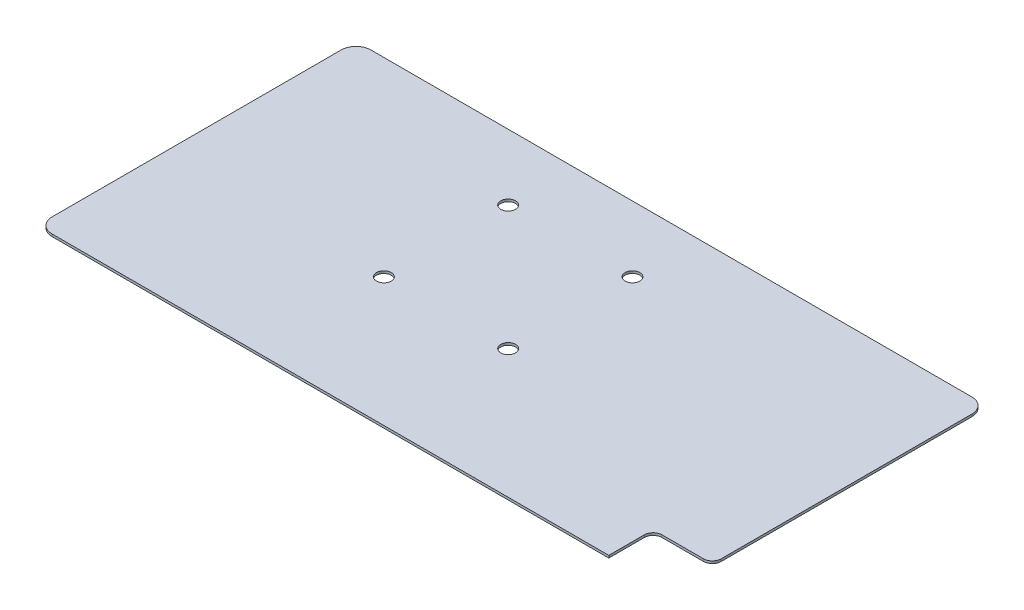
ISO-10303-21;
HEADER;
FILE_DESCRIPTION(('STEP AP214'),'2;1');
FILE_NAME('part.step','',(''),(''),'','','');
FILE_SCHEMA(('AUTOMOTIVE_DESIGN { 1 0 10303 214 1 1 1 1 }'));
ENDSEC;
DATA;
#1=APPLICATION_CONTEXT('core data for automotive mechanical design processes');
#2=APPLICATION_PROTOCOL_DEFINITION('international standard','automotive_design',2000,#1);
#3=PRODUCT_CONTEXT('',#1,'mechanical');
#4=PRODUCT('Part','Part','',(#3));
#5=PRODUCT_RELATED_PRODUCT_CATEGORY('part','',(#4));
#6=PRODUCT_DEFINITION_FORMATION('','',#4);
#7=PRODUCT_DEFINITION_CONTEXT('part definition',#1,'design');
#8=PRODUCT_DEFINITION('design','',#6,#7);
#9=PRODUCT_DEFINITION_SHAPE('','',#8);
#10=(LENGTH_UNIT() NAMED_UNIT(*) SI_UNIT(.MILLI.,.METRE.));
#11=(NAMED_UNIT(*) PLANE_ANGLE_UNIT() SI_UNIT($,.RADIAN.));
#12=(NAMED_UNIT(*) SI_UNIT($,.STERADIAN.) SOLID_ANGLE_UNIT());
#13=UNCERTAINTY_MEASURE_WITH_UNIT(LENGTH_MEASURE(1.E-05),#10,'distance_accuracy_value','');
#14=(GEOMETRIC_REPRESENTATION_CONTEXT(3) GLOBAL_UNCERTAINTY_ASSIGNED_CONTEXT((#13)) GLOBAL_UNIT_ASSIGNED_CONTEXT((#10,
#11,#12)) REPRESENTATION_CONTEXT('',''));
#15=CARTESIAN_POINT('',(0.,0.,0.));
#16=DIRECTION('',(0.,0.,1.));
#17=DIRECTION('',(1.,0.,0.));
#18=AXIS2_PLACEMENT_3D('',#15,#16,#17);
#19=CARTESIAN_POINT('',(196.1,0.8,95.7));
#20=DIRECTION('',(0.,-1.,0.));
#21=DIRECTION('',(0.,0.,-1.));
#22=AXIS2_PLACEMENT_3D('',#19,#20,#21);
#23=PLANE('',#22);
#24=CARTESIAN_POINT('',(196.1,0.8,95.7));
#25=DIRECTION('',(0.,-1.,0.));
#26=DIRECTION('',(0.,0.,-1.));
#27=AXIS2_PLACEMENT_3D('',#24,#25,#26);
#28=CIRCLE('',#27,3.);
#29=CARTESIAN_POINT('',(193.1,0.8,95.7));
#30=VERTEX_POINT('',#29);
#31=CARTESIAN_POINT('',(196.1,0.8,92.7));
#32=VERTEX_POINT('',#31);
#33=EDGE_CURVE('E194',#30,#32,#28,.T.);
#34=ORIENTED_EDGE('',*,*,#33,.T.);
#35=DIRECTION('',(1.,0.,0.));
#36=VECTOR('',#35,1.);
#37=CARTESIAN_POINT('',(196.1,0.8,92.7));
#38=LINE('',#37,#36);
#39=CARTESIAN_POINT('',(210.1,0.8,92.7));
#40=VERTEX_POINT('',#39);
#41=EDGE_CURVE('E106',#32,#40,#38,.T.);
#42=ORIENTED_EDGE('',*,*,#41,.T.);
#43=CARTESIAN_POINT('',(210.1,0.8,89.7));
#44=DIRECTION('',(0.,1.,0.));
#45=DIRECTION('',(0.,0.,1.));
#46=AXIS2_PLACEMENT_3D('',#43,#44,#45);
#47=CIRCLE('',#46,3.);
#48=CARTESIAN_POINT('',(213.1,0.8,89.7));
#49=VERTEX_POINT('',#48);
#50=EDGE_CURVE('E227',#40,#49,#47,.T.);
#51=ORIENTED_EDGE('',*,*,#50,.T.);
#52=DIRECTION('',(0.,0.,-1.));
#53=VECTOR('',#52,1.);
#54=CARTESIAN_POINT('',(213.1,0.8,89.7));
#55=LINE('',#54,#53);
#56=CARTESIAN_POINT('',(213.1,0.8,5.00000000000004));
#57=VERTEX_POINT('',#56);
#58=EDGE_CURVE('E244',#49,#57,#55,.T.);
#59=ORIENTED_EDGE('',*,*,#58,.T.);
#60=CARTESIAN_POINT('',(208.1,0.8,5.));
#61=DIRECTION('',(0.,1.,0.));
#62=DIRECTION('',(0.,0.,-1.));
#63=AXIS2_PLACEMENT_3D('',#60,#61,#62);
#64=CIRCLE('',#63,5.);
#65=CARTESIAN_POINT('',(208.1,0.8,0.));
#66=VERTEX_POINT('',#65);
#67=EDGE_CURVE('E240',#57,#66,#64,.T.);
#68=ORIENTED_EDGE('',*,*,#67,.T.);
#69=DIRECTION('',(-1.,0.,0.));
#70=VECTOR('',#69,1.);
#71=CARTESIAN_POINT('',(5.00000000000004,0.8,0.));
#72=LINE('',#71,#70);
#73=CARTESIAN_POINT('',(5.00000000000004,0.8,0.));
#74=VERTEX_POINT('',#73);
#75=EDGE_CURVE('E243',#66,#74,#72,.T.);
#76=ORIENTED_EDGE('',*,*,#75,.T.);
#77=CARTESIAN_POINT('',(5.,0.8,5.));
#78=DIRECTION('',(0.,1.,0.));
#79=DIRECTION('',(0.,0.,1.));
#80=AXIS2_PLACEMENT_3D('',#77,#78,#79);
#81=CIRCLE('',#80,5.);
#82=CARTESIAN_POINT('',(0.,0.8,5.00000000000003));
#83=VERTEX_POINT('',#82);
#84=EDGE_CURVE('E248',#74,#83,#81,.T.);
#85=ORIENTED_EDGE('',*,*,#84,.T.);
#86=DIRECTION('',(0.,0.,1.));
#87=VECTOR('',#86,1.);
#88=CARTESIAN_POINT('',(0.,0.8,5.00000000000003));
#89=LINE('',#88,#87);
#90=CARTESIAN_POINT('',(0.,0.8,102.7));
#91=VERTEX_POINT('',#90);
#92=EDGE_CURVE('E135',#83,#91,#89,.T.);
#93=ORIENTED_EDGE('',*,*,#92,.T.);
#94=CARTESIAN_POINT('',(5.,0.8,102.7));
#95=DIRECTION('',(0.,1.,0.));
#96=DIRECTION('',(0.,0.,1.));
#97=AXIS2_PLACEMENT_3D('',#94,#95,#96);
#98=CIRCLE('',#97,5.);
#99=CARTESIAN_POINT('',(5.00000000000004,0.8,107.7));
#100=VERTEX_POINT('',#99);
#101=EDGE_CURVE('E128',#91,#100,#98,.T.);
#102=ORIENTED_EDGE('',*,*,#101,.T.);
#103=DIRECTION('',(1.,0.,0.));
#104=VECTOR('',#103,1.);
#105=CARTESIAN_POINT('',(5.00000000000004,0.8,107.7));
#106=LINE('',#105,#104);
#107=CARTESIAN_POINT('',(193.1,0.8,107.7));
#108=VERTEX_POINT('',#107);
#109=EDGE_CURVE('E132',#100,#108,#106,.T.);
#110=ORIENTED_EDGE('',*,*,#109,.T.);
#111=DIRECTION('',(0.,0.,-1.));
#112=VECTOR('',#111,1.);
#113=CARTESIAN_POINT('',(193.1,0.8,102.7));
#114=LINE('',#113,#112);
#115=EDGE_CURVE('E57',#108,#30,#114,.T.);
#116=ORIENTED_EDGE('',*,*,#115,.T.);
#117=EDGE_LOOP('',(#34,#42,#51,#59,#68,#76,#85,#93,#102,#110,#116));
#118=FACE_BOUND('',#117,.T.);
#119=CARTESIAN_POINT('',(73.6000000000001,0.8,22.2));
#120=DIRECTION('',(0.,1.,0.));
#121=DIRECTION('',(0.,0.,1.));
#122=AXIS2_PLACEMENT_3D('',#119,#120,#121);
#123=CIRCLE('',#122,2.5);
#124=CARTESIAN_POINT('',(73.6000000000001,0.8,24.7));
#125=VERTEX_POINT('',#124);
#126=EDGE_CURVE('E165',#125,#125,#123,.T.);
#127=ORIENTED_EDGE('',*,*,#126,.F.);
#128=EDGE_LOOP('',(#127));
#129=FACE_BOUND('',#128,.T.);
#130=CARTESIAN_POINT('',(115.6,0.8,22.199999999999));
#131=DIRECTION('',(0.,1.,0.));
#132=DIRECTION('',(0.,0.,1.));
#133=AXIS2_PLACEMENT_3D('',#130,#131,#132);
#134=CIRCLE('',#133,2.50000000000001);
#135=CARTESIAN_POINT('',(115.6,0.8,24.699999999999));
#136=VERTEX_POINT('',#135);
#137=EDGE_CURVE('E278',#136,#136,#134,.T.);
#138=ORIENTED_EDGE('',*,*,#137,.F.);
#139=EDGE_LOOP('',(#138));
#140=FACE_BOUND('',#139,.T.);
#141=CARTESIAN_POINT('',(115.6,0.8,64.1999999999998));
#142=DIRECTION('',(0.,1.,0.));
#143=DIRECTION('',(0.,0.,1.));
#144=AXIS2_PLACEMENT_3D('',#141,#142,#143);
#145=CIRCLE('',#144,2.50000000000001);
#146=CARTESIAN_POINT('',(115.6,0.8,66.6999999999998));
#147=VERTEX_POINT('',#146);
#148=EDGE_CURVE('E286',#147,#147,#145,.T.);
#149=ORIENTED_EDGE('',*,*,#148,.F.);
#150=EDGE_LOOP('',(#149));
#151=FACE_BOUND('',#150,.T.);
#152=CARTESIAN_POINT('',(73.5999999999995,0.8,64.1999999999998));
#153=DIRECTION('',(0.,1.,0.));
#154=DIRECTION('',(0.,0.,1.));
#155=AXIS2_PLACEMENT_3D('',#152,#153,#154);
#156=CIRCLE('',#155,2.5);
#157=CARTESIAN_POINT('',(73.5999999999995,0.8,66.6999999999998));
#158=VERTEX_POINT('',#157);
#159=EDGE_CURVE('E294',#158,#158,#156,.T.);
#160=ORIENTED_EDGE('',*,*,#159,.F.);
#161=EDGE_LOOP('',(#160));
#162=FACE_BOUND('',#161,.T.);
#163=ADVANCED_FACE('F39',(#118,#129,#140,#151,#162),#23,.F.);
#164=CARTESIAN_POINT('',(196.1,0.,95.7));
#165=DIRECTION('',(0.,-1.,0.));
#166=DIRECTION('',(0.,0.,-1.));
#167=AXIS2_PLACEMENT_3D('',#164,#165,#166);
#168=PLANE('',#167);
#169=CARTESIAN_POINT('',(115.6,0.,64.1999999999998));
#170=DIRECTION('',(0.,1.,0.));
#171=DIRECTION('',(0.,0.,1.));
#172=AXIS2_PLACEMENT_3D('',#169,#170,#171);
#173=CIRCLE('',#172,2.50000000000001);
#174=CARTESIAN_POINT('',(115.6,0.,66.6999999999998));
#175=VERTEX_POINT('',#174);
#176=EDGE_CURVE('E290',#175,#175,#173,.T.);
#177=ORIENTED_EDGE('',*,*,#176,.T.);
#178=EDGE_LOOP('',(#177));
#179=FACE_BOUND('',#178,.T.);
#180=CARTESIAN_POINT('',(73.6000000000001,0.,22.2));
#181=DIRECTION('',(0.,1.,0.));
#182=DIRECTION('',(0.,0.,1.));
#183=AXIS2_PLACEMENT_3D('',#180,#181,#182);
#184=CIRCLE('',#183,2.5);
#185=CARTESIAN_POINT('',(73.6000000000001,0.,24.7));
#186=VERTEX_POINT('',#185);
#187=EDGE_CURVE('E273',#186,#186,#184,.T.);
#188=ORIENTED_EDGE('',*,*,#187,.T.);
#189=EDGE_LOOP('',(#188));
#190=FACE_BOUND('',#189,.T.);
#191=CARTESIAN_POINT('',(196.1,0.,95.7));
#192=DIRECTION('',(0.,-1.,0.));
#193=DIRECTION('',(0.,0.,-1.));
#194=AXIS2_PLACEMENT_3D('',#191,#192,#193);
#195=CIRCLE('',#194,3.);
#196=CARTESIAN_POINT('',(193.1,0.,95.7));
#197=VERTEX_POINT('',#196);
#198=CARTESIAN_POINT('',(196.1,0.,92.7));
#199=VERTEX_POINT('',#198);
#200=EDGE_CURVE('E160',#197,#199,#195,.T.);
#201=ORIENTED_EDGE('',*,*,#200,.F.);
#202=DIRECTION('',(0.,0.,-1.));
#203=VECTOR('',#202,1.);
#204=CARTESIAN_POINT('',(193.1,0.,95.7));
#205=LINE('',#204,#203);
#206=CARTESIAN_POINT('',(193.1,0.,107.7));
#207=VERTEX_POINT('',#206);
#208=EDGE_CURVE('E94',#207,#197,#205,.T.);
#209=ORIENTED_EDGE('',*,*,#208,.F.);
#210=DIRECTION('',(1.,0.,0.));
#211=VECTOR('',#210,1.);
#212=CARTESIAN_POINT('',(193.1,0.,107.7));
#213=LINE('',#212,#211);
#214=CARTESIAN_POINT('',(5.00000000000004,0.,107.7));
#215=VERTEX_POINT('',#214);
#216=EDGE_CURVE('E189',#215,#207,#213,.T.);
#217=ORIENTED_EDGE('',*,*,#216,.F.);
#218=CARTESIAN_POINT('',(5.,0.,102.7));
#219=DIRECTION('',(0.,1.,0.));
#220=DIRECTION('',(0.,0.,1.));
#221=AXIS2_PLACEMENT_3D('',#218,#219,#220);
#222=CIRCLE('',#221,5.);
#223=CARTESIAN_POINT('',(0.,0.,102.7));
#224=VERTEX_POINT('',#223);
#225=EDGE_CURVE('E146',#224,#215,#222,.T.);
#226=ORIENTED_EDGE('',*,*,#225,.F.);
#227=DIRECTION('',(0.,0.,1.));
#228=VECTOR('',#227,1.);
#229=CARTESIAN_POINT('',(0.,0.,5.00000000000003));
#230=LINE('',#229,#228);
#231=CARTESIAN_POINT('',(0.,0.,5.00000000000003));
#232=VERTEX_POINT('',#231);
#233=EDGE_CURVE('E184',#232,#224,#230,.T.);
#234=ORIENTED_EDGE('',*,*,#233,.F.);
#235=CARTESIAN_POINT('',(5.,0.,5.));
#236=DIRECTION('',(0.,1.,0.));
#237=DIRECTION('',(0.,0.,1.));
#238=AXIS2_PLACEMENT_3D('',#235,#236,#237);
#239=CIRCLE('',#238,5.);
#240=CARTESIAN_POINT('',(5.00000000000004,0.,0.));
#241=VERTEX_POINT('',#240);
#242=EDGE_CURVE('E181',#241,#232,#239,.T.);
#243=ORIENTED_EDGE('',*,*,#242,.F.);
#244=DIRECTION('',(-1.,0.,0.));
#245=VECTOR('',#244,1.);
#246=CARTESIAN_POINT('',(5.00000000000004,0.,0.));
#247=LINE('',#246,#245);
#248=CARTESIAN_POINT('',(208.1,0.,0.));
#249=VERTEX_POINT('',#248);
#250=EDGE_CURVE('E178',#249,#241,#247,.T.);
#251=ORIENTED_EDGE('',*,*,#250,.F.);
#252=CARTESIAN_POINT('',(208.1,0.,5.));
#253=DIRECTION('',(0.,1.,0.));
#254=DIRECTION('',(0.,0.,-1.));
#255=AXIS2_PLACEMENT_3D('',#252,#253,#254);
#256=CIRCLE('',#255,5.);
#257=CARTESIAN_POINT('',(213.1,0.,5.00000000000004));
#258=VERTEX_POINT('',#257);
#259=EDGE_CURVE('E175',#258,#249,#256,.T.);
#260=ORIENTED_EDGE('',*,*,#259,.F.);
#261=DIRECTION('',(0.,0.,-1.));
#262=VECTOR('',#261,1.);
#263=CARTESIAN_POINT('',(213.1,0.,5.00000000000004));
#264=LINE('',#263,#262);
#265=CARTESIAN_POINT('',(213.1,0.,89.7));
#266=VERTEX_POINT('',#265);
#267=EDGE_CURVE('E172',#266,#258,#264,.T.);
#268=ORIENTED_EDGE('',*,*,#267,.F.);
#269=CARTESIAN_POINT('',(210.1,0.,89.7));
#270=DIRECTION('',(0.,1.,0.));
#271=DIRECTION('',(0.,0.,1.));
#272=AXIS2_PLACEMENT_3D('',#269,#270,#271);
#273=CIRCLE('',#272,3.);
#274=CARTESIAN_POINT('',(210.1,0.,92.7));
#275=VERTEX_POINT('',#274);
#276=EDGE_CURVE('E168',#275,#266,#273,.T.);
#277=ORIENTED_EDGE('',*,*,#276,.F.);
#278=DIRECTION('',(1.,0.,0.));
#279=VECTOR('',#278,1.);
#280=CARTESIAN_POINT('',(196.1,0.,92.7));
#281=LINE('',#280,#279);
#282=EDGE_CURVE('E164',#199,#275,#281,.T.);
#283=ORIENTED_EDGE('',*,*,#282,.F.);
#284=EDGE_LOOP('',(#201,#209,#217,#226,#234,#243,#251,#260,#268,#277,#283));
#285=FACE_BOUND('',#284,.T.);
#286=CARTESIAN_POINT('',(115.6,0.,22.199999999999));
#287=DIRECTION('',(0.,1.,0.));
#288=DIRECTION('',(0.,0.,1.));
#289=AXIS2_PLACEMENT_3D('',#286,#287,#288);
#290=CIRCLE('',#289,2.50000000000001);
#291=CARTESIAN_POINT('',(115.6,0.,24.699999999999));
#292=VERTEX_POINT('',#291);
#293=EDGE_CURVE('E282',#292,#292,#290,.T.);
#294=ORIENTED_EDGE('',*,*,#293,.T.);
#295=EDGE_LOOP('',(#294));
#296=FACE_BOUND('',#295,.T.);
#297=CARTESIAN_POINT('',(73.5999999999995,0.,64.1999999999998));
#298=DIRECTION('',(0.,1.,0.));
#299=DIRECTION('',(0.,0.,1.));
#300=AXIS2_PLACEMENT_3D('',#297,#298,#299);
#301=CIRCLE('',#300,2.5);
#302=CARTESIAN_POINT('',(73.5999999999995,0.,66.6999999999998));
#303=VERTEX_POINT('',#302);
#304=EDGE_CURVE('E298',#303,#303,#301,.T.);
#305=ORIENTED_EDGE('',*,*,#304,.T.);
#306=EDGE_LOOP('',(#305));
#307=FACE_BOUND('',#306,.T.);
#308=ADVANCED_FACE('F228',(#179,#190,#285,#296,#307),#168,.T.);
#309=CARTESIAN_POINT('',(196.1,0.8,95.7));
#310=DIRECTION('',(0.,-1.,0.));
#311=DIRECTION('',(0.,0.,-1.));
#312=AXIS2_PLACEMENT_3D('',#309,#310,#311);
#313=CYLINDRICAL_SURFACE('',#312,3.);
#314=ORIENTED_EDGE('',*,*,#200,.T.);
#315=DIRECTION('',(0.,-1.,0.));
#316=VECTOR('',#315,1.);
#317=CARTESIAN_POINT('',(196.1,0.8,92.7));
#318=LINE('',#317,#316);
#319=EDGE_CURVE('E11',#32,#199,#318,.T.);
#320=ORIENTED_EDGE('',*,*,#319,.F.);
#321=ORIENTED_EDGE('',*,*,#33,.F.);
#322=DIRECTION('',(0.,-1.,0.));
#323=VECTOR('',#322,1.);
#324=CARTESIAN_POINT('',(193.1,0.8,95.7));
#325=LINE('',#324,#323);
#326=EDGE_CURVE('E156',#30,#197,#325,.T.);
#327=ORIENTED_EDGE('',*,*,#326,.T.);
#328=EDGE_LOOP('',(#314,#320,#321,#327));
#329=FACE_BOUND('',#328,.T.);
#330=ADVANCED_FACE('F41',(#329),#313,.F.);
#331=CARTESIAN_POINT('',(196.1,0.8,92.7));
#332=DIRECTION('',(0.,0.,-1.));
#333=DIRECTION('',(-1.,0.,0.));
#334=AXIS2_PLACEMENT_3D('',#331,#332,#333);
#335=PLANE('',#334);
#336=ORIENTED_EDGE('',*,*,#282,.T.);
#337=DIRECTION('',(0.,-1.,0.));
#338=VECTOR('',#337,1.);
#339=CARTESIAN_POINT('',(210.1,0.8,92.7));
#340=LINE('',#339,#338);
#341=EDGE_CURVE('E49',#40,#275,#340,.T.);
#342=ORIENTED_EDGE('',*,*,#341,.F.);
#343=ORIENTED_EDGE('',*,*,#41,.F.);
#344=ORIENTED_EDGE('',*,*,#319,.T.);
#345=EDGE_LOOP('',(#336,#342,#343,#344));
#346=FACE_BOUND('',#345,.T.);
#347=ADVANCED_FACE('F339',(#346),#335,.F.);
#348=CARTESIAN_POINT('',(210.1,0.8,89.7));
#349=DIRECTION('',(0.,-1.,0.));
#350=DIRECTION('',(0.,0.,-1.));
#351=AXIS2_PLACEMENT_3D('',#348,#349,#350);
#352=CYLINDRICAL_SURFACE('',#351,3.);
#353=ORIENTED_EDGE('',*,*,#276,.T.);
#354=DIRECTION('',(0.,-1.,0.));
#355=VECTOR('',#354,1.);
#356=CARTESIAN_POINT('',(213.1,0.8,89.7));
#357=LINE('',#356,#355);
#358=EDGE_CURVE('E217',#49,#266,#357,.T.);
#359=ORIENTED_EDGE('',*,*,#358,.F.);
#360=ORIENTED_EDGE('',*,*,#50,.F.);
#361=ORIENTED_EDGE('',*,*,#341,.T.);
#362=EDGE_LOOP('',(#353,#359,#360,#361));
#363=FACE_BOUND('',#362,.T.);
#364=ADVANCED_FACE('F225',(#363),#352,.T.);
#365=CARTESIAN_POINT('',(213.1,0.8,5.00000000000004));
#366=DIRECTION('',(-1.,0.,0.));
#367=DIRECTION('',(0.,0.,1.));
#368=AXIS2_PLACEMENT_3D('',#365,#366,#367);
#369=PLANE('',#368);
#370=ORIENTED_EDGE('',*,*,#267,.T.);
#371=DIRECTION('',(0.,-1.,0.));
#372=VECTOR('',#371,1.);
#373=CARTESIAN_POINT('',(213.1,0.8,5.00000000000004));
#374=LINE('',#373,#372);
#375=EDGE_CURVE('E213',#57,#258,#374,.T.);
#376=ORIENTED_EDGE('',*,*,#375,.F.);
#377=ORIENTED_EDGE('',*,*,#58,.F.);
#378=ORIENTED_EDGE('',*,*,#358,.T.);
#379=EDGE_LOOP('',(#370,#376,#377,#378));
#380=FACE_BOUND('',#379,.T.);
#381=ADVANCED_FACE('F234',(#380),#369,.F.);
#382=CARTESIAN_POINT('',(208.1,0.8,5.));
#383=DIRECTION('',(0.,-1.,0.));
#384=DIRECTION('',(0.,0.,-1.));
#385=AXIS2_PLACEMENT_3D('',#382,#383,#384);
#386=CYLINDRICAL_SURFACE('',#385,5.);
#387=ORIENTED_EDGE('',*,*,#259,.T.);
#388=DIRECTION('',(0.,-1.,0.));
#389=VECTOR('',#388,1.);
#390=CARTESIAN_POINT('',(208.1,0.8,0.));
#391=LINE('',#390,#389);
#392=EDGE_CURVE('E209',#66,#249,#391,.T.);
#393=ORIENTED_EDGE('',*,*,#392,.F.);
#394=ORIENTED_EDGE('',*,*,#67,.F.);
#395=ORIENTED_EDGE('',*,*,#375,.T.);
#396=EDGE_LOOP('',(#387,#393,#394,#395));
#397=FACE_BOUND('',#396,.T.);
#398=ADVANCED_FACE('F238',(#397),#386,.T.);
#399=CARTESIAN_POINT('',(5.00000000000004,0.8,0.));
#400=DIRECTION('',(0.,0.,1.));
#401=DIRECTION('',(1.,0.,0.));
#402=AXIS2_PLACEMENT_3D('',#399,#400,#401);
#403=PLANE('',#402);
#404=ORIENTED_EDGE('',*,*,#250,.T.);
#405=DIRECTION('',(0.,-1.,0.));
#406=VECTOR('',#405,1.);
#407=CARTESIAN_POINT('',(5.00000000000004,0.8,0.));
#408=LINE('',#407,#406);
#409=EDGE_CURVE('E205',#74,#241,#408,.T.);
#410=ORIENTED_EDGE('',*,*,#409,.F.);
#411=ORIENTED_EDGE('',*,*,#75,.F.);
#412=ORIENTED_EDGE('',*,*,#392,.T.);
#413=EDGE_LOOP('',(#404,#410,#411,#412));
#414=FACE_BOUND('',#413,.T.);
#415=ADVANCED_FACE('F330',(#414),#403,.F.);
#416=CARTESIAN_POINT('',(5.,0.8,5.));
#417=DIRECTION('',(0.,-1.,0.));
#418=DIRECTION('',(0.,0.,-1.));
#419=AXIS2_PLACEMENT_3D('',#416,#417,#418);
#420=CYLINDRICAL_SURFACE('',#419,5.);
#421=ORIENTED_EDGE('',*,*,#242,.T.);
#422=DIRECTION('',(0.,-1.,0.));
#423=VECTOR('',#422,1.);
#424=CARTESIAN_POINT('',(0.,0.8,5.00000000000003));
#425=LINE('',#424,#423);
#426=EDGE_CURVE('E201',#83,#232,#425,.T.);
#427=ORIENTED_EDGE('',*,*,#426,.F.);
#428=ORIENTED_EDGE('',*,*,#84,.F.);
#429=ORIENTED_EDGE('',*,*,#409,.T.);
#430=EDGE_LOOP('',(#421,#427,#428,#429));
#431=FACE_BOUND('',#430,.T.);
#432=ADVANCED_FACE('F259',(#431),#420,.T.);
#433=CARTESIAN_POINT('',(0.,0.8,5.00000000000003));
#434=DIRECTION('',(1.,0.,0.));
#435=DIRECTION('',(0.,0.,-1.));
#436=AXIS2_PLACEMENT_3D('',#433,#434,#435);
#437=PLANE('',#436);
#438=ORIENTED_EDGE('',*,*,#233,.T.);
#439=DIRECTION('',(0.,-1.,0.));
#440=VECTOR('',#439,1.);
#441=CARTESIAN_POINT('',(0.,0.8,102.7));
#442=LINE('',#441,#440);
#443=EDGE_CURVE('E149',#91,#224,#442,.T.);
#444=ORIENTED_EDGE('',*,*,#443,.F.);
#445=ORIENTED_EDGE('',*,*,#92,.F.);
#446=ORIENTED_EDGE('',*,*,#426,.T.);
#447=EDGE_LOOP('',(#438,#444,#445,#446));
#448=FACE_BOUND('',#447,.T.);
#449=ADVANCED_FACE('F263',(#448),#437,.F.);
#450=CARTESIAN_POINT('',(5.,0.8,102.7));
#451=DIRECTION('',(0.,-1.,0.));
#452=DIRECTION('',(0.,0.,-1.));
#453=AXIS2_PLACEMENT_3D('',#450,#451,#452);
#454=CYLINDRICAL_SURFACE('',#453,5.);
#455=ORIENTED_EDGE('',*,*,#225,.T.);
#456=DIRECTION('',(0.,-1.,0.));
#457=VECTOR('',#456,1.);
#458=CARTESIAN_POINT('',(5.00000000000004,0.8,107.7));
#459=LINE('',#458,#457);
#460=EDGE_CURVE('E143',#100,#215,#459,.T.);
#461=ORIENTED_EDGE('',*,*,#460,.F.);
#462=ORIENTED_EDGE('',*,*,#101,.F.);
#463=ORIENTED_EDGE('',*,*,#443,.T.);
#464=EDGE_LOOP('',(#455,#461,#462,#463));
#465=FACE_BOUND('',#464,.T.);
#466=ADVANCED_FACE('F144',(#465),#454,.T.);
#467=CARTESIAN_POINT('',(193.1,0.8,107.7));
#468=DIRECTION('',(0.,0.,-1.));
#469=DIRECTION('',(-1.,0.,0.));
#470=AXIS2_PLACEMENT_3D('',#467,#468,#469);
#471=PLANE('',#470);
#472=ORIENTED_EDGE('',*,*,#216,.T.);
#473=DIRECTION('',(0.,-1.,0.));
#474=VECTOR('',#473,1.);
#475=CARTESIAN_POINT('',(193.1,0.8,107.7));
#476=LINE('',#475,#474);
#477=EDGE_CURVE('E150',#108,#207,#476,.T.);
#478=ORIENTED_EDGE('',*,*,#477,.F.);
#479=ORIENTED_EDGE('',*,*,#109,.F.);
#480=ORIENTED_EDGE('',*,*,#460,.T.);
#481=EDGE_LOOP('',(#472,#478,#479,#480));
#482=FACE_BOUND('',#481,.T.);
#483=ADVANCED_FACE('F152',(#482),#471,.F.);
#484=CARTESIAN_POINT('',(193.1,0.8,95.7));
#485=DIRECTION('',(-1.,0.,0.));
#486=DIRECTION('',(0.,0.,1.));
#487=AXIS2_PLACEMENT_3D('',#484,#485,#486);
#488=PLANE('',#487);
#489=ORIENTED_EDGE('',*,*,#208,.T.);
#490=ORIENTED_EDGE('',*,*,#326,.F.);
#491=ORIENTED_EDGE('',*,*,#115,.F.);
#492=ORIENTED_EDGE('',*,*,#477,.T.);
#493=EDGE_LOOP('',(#489,#490,#491,#492));
#494=FACE_BOUND('',#493,.T.);
#495=ADVANCED_FACE('F264',(#494),#488,.F.);
#496=CARTESIAN_POINT('',(73.6000000000001,0.8,22.2));
#497=DIRECTION('',(0.,-1.,0.));
#498=DIRECTION('',(0.,0.,-1.));
#499=AXIS2_PLACEMENT_3D('',#496,#497,#498);
#500=CYLINDRICAL_SURFACE('',#499,2.5);
#501=ORIENTED_EDGE('',*,*,#126,.T.);
#502=EDGE_LOOP('',(#501));
#503=FACE_BOUND('',#502,.T.);
#504=ORIENTED_EDGE('',*,*,#187,.F.);
#505=EDGE_LOOP('',(#504));
#506=FACE_BOUND('',#505,.T.);
#507=ADVANCED_FACE('F317',(#503,#506),#500,.F.);
#508=CARTESIAN_POINT('',(115.6,0.8,22.199999999999));
#509=DIRECTION('',(0.,-1.,0.));
#510=DIRECTION('',(0.,0.,-1.));
#511=AXIS2_PLACEMENT_3D('',#508,#509,#510);
#512=CYLINDRICAL_SURFACE('',#511,2.50000000000001);
#513=ORIENTED_EDGE('',*,*,#137,.T.);
#514=EDGE_LOOP('',(#513));
#515=FACE_BOUND('',#514,.T.);
#516=ORIENTED_EDGE('',*,*,#293,.F.);
#517=EDGE_LOOP('',(#516));
#518=FACE_BOUND('',#517,.T.);
#519=ADVANCED_FACE('F427',(#515,#518),#512,.F.);
#520=CARTESIAN_POINT('',(115.6,0.8,64.1999999999998));
#521=DIRECTION('',(0.,-1.,0.));
#522=DIRECTION('',(0.,0.,-1.));
#523=AXIS2_PLACEMENT_3D('',#520,#521,#522);
#524=CYLINDRICAL_SURFACE('',#523,2.50000000000001);
#525=ORIENTED_EDGE('',*,*,#148,.T.);
#526=EDGE_LOOP('',(#525));
#527=FACE_BOUND('',#526,.T.);
#528=ORIENTED_EDGE('',*,*,#176,.F.);
#529=EDGE_LOOP('',(#528));
#530=FACE_BOUND('',#529,.T.);
#531=ADVANCED_FACE('F435',(#527,#530),#524,.F.);
#532=CARTESIAN_POINT('',(73.5999999999995,0.8,64.1999999999998));
#533=DIRECTION('',(0.,-1.,0.));
#534=DIRECTION('',(0.,0.,-1.));
#535=AXIS2_PLACEMENT_3D('',#532,#533,#534);
#536=CYLINDRICAL_SURFACE('',#535,2.5);
#537=ORIENTED_EDGE('',*,*,#159,.T.);
#538=EDGE_LOOP('',(#537));
#539=FACE_BOUND('',#538,.T.);
#540=ORIENTED_EDGE('',*,*,#304,.F.);
#541=EDGE_LOOP('',(#540));
#542=FACE_BOUND('',#541,.T.);
#543=ADVANCED_FACE('F306',(#539,#542),#536,.F.);
#544=CLOSED_SHELL('',(#163,#308,#330,#347,#364,#381,#398,#415,#432,#449,#466,#483,#495,#507,
#519,#531,#543));
#545=MANIFOLD_SOLID_BREP('B2',#544);
#546=ADVANCED_BREP_SHAPE_REPRESENTATION('',(#18,#545),#14);
#547=SHAPE_DEFINITION_REPRESENTATION(#9,#546);
ENDSEC;
END-ISO-10303-21;
